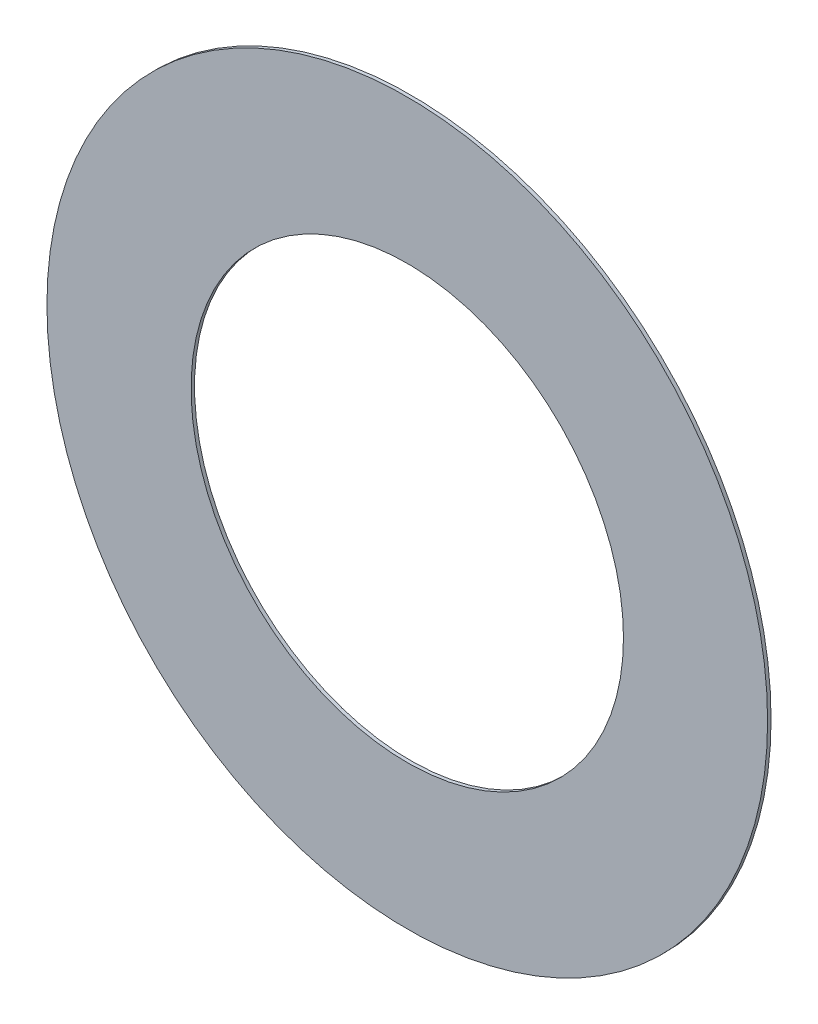
ISO-10303-21;
HEADER;
FILE_DESCRIPTION(('STEP AP214'),'2;1');
FILE_NAME('part.step','',(''),(''),'','','');
FILE_SCHEMA(('AUTOMOTIVE_DESIGN { 1 0 10303 214 1 1 1 1 }'));
ENDSEC;
DATA;
#1=APPLICATION_CONTEXT('core data for automotive mechanical design processes');
#2=APPLICATION_PROTOCOL_DEFINITION('international standard','automotive_design',2000,#1);
#3=PRODUCT_CONTEXT('',#1,'mechanical');
#4=PRODUCT('Part','Part','',(#3));
#5=PRODUCT_RELATED_PRODUCT_CATEGORY('part','',(#4));
#6=PRODUCT_DEFINITION_FORMATION('','',#4);
#7=PRODUCT_DEFINITION_CONTEXT('part definition',#1,'design');
#8=PRODUCT_DEFINITION('design','',#6,#7);
#9=PRODUCT_DEFINITION_SHAPE('','',#8);
#10=(LENGTH_UNIT() NAMED_UNIT(*) SI_UNIT(.MILLI.,.METRE.));
#11=(NAMED_UNIT(*) PLANE_ANGLE_UNIT() SI_UNIT($,.RADIAN.));
#12=(NAMED_UNIT(*) SI_UNIT($,.STERADIAN.) SOLID_ANGLE_UNIT());
#13=UNCERTAINTY_MEASURE_WITH_UNIT(LENGTH_MEASURE(1.E-05),#10,'distance_accuracy_value','');
#14=(GEOMETRIC_REPRESENTATION_CONTEXT(3) GLOBAL_UNCERTAINTY_ASSIGNED_CONTEXT((#13)) GLOBAL_UNIT_ASSIGNED_CONTEXT((#10,
#11,#12)) REPRESENTATION_CONTEXT('',''));
#15=CARTESIAN_POINT('',(0.,0.,0.));
#16=DIRECTION('',(0.,0.,1.));
#17=DIRECTION('',(1.,0.,0.));
#18=AXIS2_PLACEMENT_3D('',#15,#16,#17);
#19=CARTESIAN_POINT('',(0.,0.,0.0762));
#20=DIRECTION('',(0.,0.,1.));
#21=DIRECTION('',(1.,0.,0.));
#22=AXIS2_PLACEMENT_3D('',#19,#20,#21);
#23=PLANE('',#22);
#24=CARTESIAN_POINT('',(0.,0.,0.0762));
#25=DIRECTION('',(0.,0.,1.));
#26=DIRECTION('',(1.,0.,0.));
#27=AXIS2_PLACEMENT_3D('',#24,#25,#26);
#28=CIRCLE('',#27,7.9375);
#29=CARTESIAN_POINT('',(7.9375,0.,0.0762));
#30=VERTEX_POINT('',#29);
#31=EDGE_CURVE('E10',#30,#30,#28,.T.);
#32=ORIENTED_EDGE('',*,*,#31,.T.);
#33=EDGE_LOOP('',(#32));
#34=FACE_BOUND('',#33,.T.);
#35=CARTESIAN_POINT('',(0.,0.,0.0762));
#36=DIRECTION('',(0.,0.,1.));
#37=DIRECTION('',(1.,0.,0.));
#38=AXIS2_PLACEMENT_3D('',#35,#36,#37);
#39=CIRCLE('',#38,4.7625);
#40=CARTESIAN_POINT('',(4.7625,0.,0.0762));
#41=VERTEX_POINT('',#40);
#42=EDGE_CURVE('E42',#41,#41,#39,.T.);
#43=ORIENTED_EDGE('',*,*,#42,.F.);
#44=EDGE_LOOP('',(#43));
#45=FACE_BOUND('',#44,.T.);
#46=ADVANCED_FACE('F31',(#34,#45),#23,.T.);
#47=CARTESIAN_POINT('',(0.,0.,0.));
#48=DIRECTION('',(0.,0.,1.));
#49=DIRECTION('',(1.,0.,0.));
#50=AXIS2_PLACEMENT_3D('',#47,#48,#49);
#51=PLANE('',#50);
#52=CARTESIAN_POINT('',(0.,0.,0.));
#53=DIRECTION('',(0.,0.,1.));
#54=DIRECTION('',(1.,0.,0.));
#55=AXIS2_PLACEMENT_3D('',#52,#53,#54);
#56=CIRCLE('',#55,7.9375);
#57=CARTESIAN_POINT('',(7.9375,0.,0.));
#58=VERTEX_POINT('',#57);
#59=EDGE_CURVE('E35',#58,#58,#56,.T.);
#60=ORIENTED_EDGE('',*,*,#59,.F.);
#61=EDGE_LOOP('',(#60));
#62=FACE_BOUND('',#61,.T.);
#63=CARTESIAN_POINT('',(0.,0.,0.));
#64=DIRECTION('',(0.,0.,1.));
#65=DIRECTION('',(1.,0.,0.));
#66=AXIS2_PLACEMENT_3D('',#63,#64,#65);
#67=CIRCLE('',#66,4.7625);
#68=CARTESIAN_POINT('',(4.7625,0.,0.));
#69=VERTEX_POINT('',#68);
#70=EDGE_CURVE('E44',#69,#69,#67,.T.);
#71=ORIENTED_EDGE('',*,*,#70,.T.);
#72=EDGE_LOOP('',(#71));
#73=FACE_BOUND('',#72,.T.);
#74=ADVANCED_FACE('F54',(#62,#73),#51,.F.);
#75=CARTESIAN_POINT('',(0.,0.,0.0762));
#76=DIRECTION('',(0.,0.,-1.));
#77=DIRECTION('',(-1.,0.,0.));
#78=AXIS2_PLACEMENT_3D('',#75,#76,#77);
#79=CYLINDRICAL_SURFACE('',#78,7.9375);
#80=ORIENTED_EDGE('',*,*,#31,.F.);
#81=EDGE_LOOP('',(#80));
#82=FACE_BOUND('',#81,.T.);
#83=ORIENTED_EDGE('',*,*,#59,.T.);
#84=EDGE_LOOP('',(#83));
#85=FACE_BOUND('',#84,.T.);
#86=ADVANCED_FACE('F33',(#82,#85),#79,.T.);
#87=CARTESIAN_POINT('',(0.,0.,0.0762));
#88=DIRECTION('',(0.,0.,-1.));
#89=DIRECTION('',(-1.,0.,0.));
#90=AXIS2_PLACEMENT_3D('',#87,#88,#89);
#91=CYLINDRICAL_SURFACE('',#90,4.7625);
#92=ORIENTED_EDGE('',*,*,#42,.T.);
#93=EDGE_LOOP('',(#92));
#94=FACE_BOUND('',#93,.T.);
#95=ORIENTED_EDGE('',*,*,#70,.F.);
#96=EDGE_LOOP('',(#95));
#97=FACE_BOUND('',#96,.T.);
#98=ADVANCED_FACE('F50',(#94,#97),#91,.F.);
#99=CLOSED_SHELL('',(#46,#74,#86,#98));
#100=MANIFOLD_SOLID_BREP('B2',#99);
#101=ADVANCED_BREP_SHAPE_REPRESENTATION('',(#18,#100),#14);
#102=SHAPE_DEFINITION_REPRESENTATION(#9,#101);
ENDSEC;
END-ISO-10303-21;
